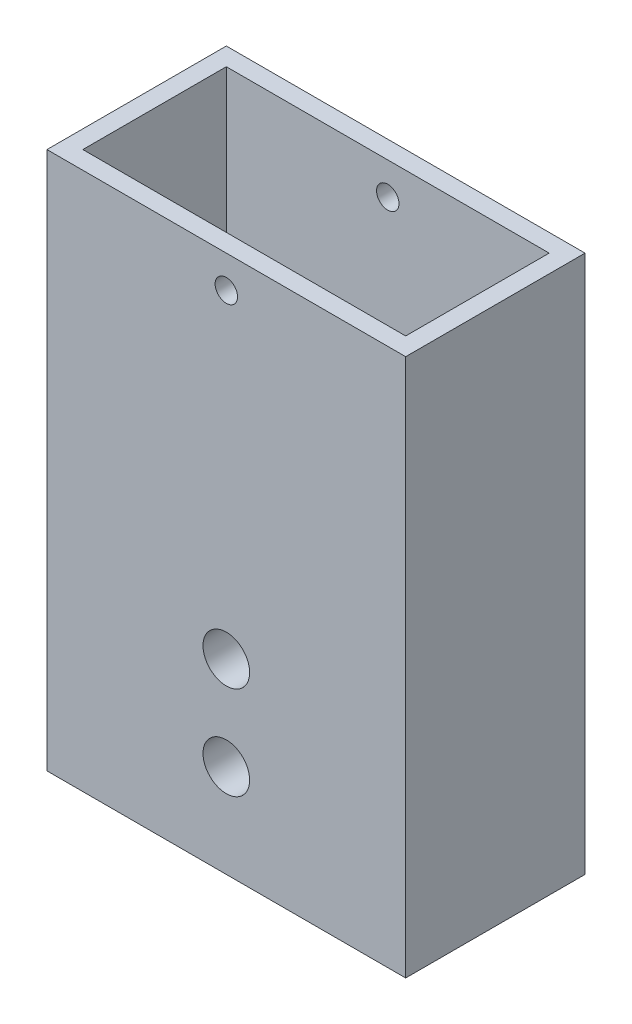
ISO-10303-21;
HEADER;
FILE_DESCRIPTION(('STEP AP214'),'2;1');
FILE_NAME('part.step','',(''),(''),'','','');
FILE_SCHEMA(('AUTOMOTIVE_DESIGN { 1 0 10303 214 1 1 1 1 }'));
ENDSEC;
DATA;
#1=APPLICATION_CONTEXT('core data for automotive mechanical design processes');
#2=APPLICATION_PROTOCOL_DEFINITION('international standard','automotive_design',2000,#1);
#3=PRODUCT_CONTEXT('',#1,'mechanical');
#4=PRODUCT('Part','Part','',(#3));
#5=PRODUCT_RELATED_PRODUCT_CATEGORY('part','',(#4));
#6=PRODUCT_DEFINITION_FORMATION('','',#4);
#7=PRODUCT_DEFINITION_CONTEXT('part definition',#1,'design');
#8=PRODUCT_DEFINITION('design','',#6,#7);
#9=PRODUCT_DEFINITION_SHAPE('','',#8);
#10=(LENGTH_UNIT() NAMED_UNIT(*) SI_UNIT(.MILLI.,.METRE.));
#11=(NAMED_UNIT(*) PLANE_ANGLE_UNIT() SI_UNIT($,.RADIAN.));
#12=(NAMED_UNIT(*) SI_UNIT($,.STERADIAN.) SOLID_ANGLE_UNIT());
#13=UNCERTAINTY_MEASURE_WITH_UNIT(LENGTH_MEASURE(1.E-05),#10,'distance_accuracy_value','');
#14=(GEOMETRIC_REPRESENTATION_CONTEXT(3) GLOBAL_UNCERTAINTY_ASSIGNED_CONTEXT((#13)) GLOBAL_UNIT_ASSIGNED_CONTEXT((#10,
#11,#12)) REPRESENTATION_CONTEXT('',''));
#15=CARTESIAN_POINT('',(0.,0.,0.));
#16=DIRECTION('',(0.,0.,1.));
#17=DIRECTION('',(1.,0.,0.));
#18=AXIS2_PLACEMENT_3D('',#15,#16,#17);
#19=CARTESIAN_POINT('',(0.,0.,25.4));
#20=DIRECTION('',(0.,0.,-1.));
#21=DIRECTION('',(-1.,0.,0.));
#22=AXIS2_PLACEMENT_3D('',#19,#20,#21);
#23=PLANE('',#22);
#24=CARTESIAN_POINT('',(25.4,71.628,25.4));
#25=DIRECTION('',(0.,0.,1.));
#26=DIRECTION('',(1.,0.,0.));
#27=AXIS2_PLACEMENT_3D('',#24,#25,#26);
#28=CIRCLE('',#27,1.5875);
#29=CARTESIAN_POINT('',(26.9875,71.628,25.4));
#30=VERTEX_POINT('',#29);
#31=EDGE_CURVE('E287',#30,#30,#28,.T.);
#32=ORIENTED_EDGE('',*,*,#31,.F.);
#33=EDGE_LOOP('',(#32));
#34=FACE_BOUND('',#33,.T.);
#35=DIRECTION('',(0.,-1.,0.));
#36=VECTOR('',#35,1.);
#37=CARTESIAN_POINT('',(0.,0.,25.4));
#38=LINE('',#37,#36);
#39=CARTESIAN_POINT('',(0.,76.2,25.4));
#40=VERTEX_POINT('',#39);
#41=CARTESIAN_POINT('',(0.,0.,25.4));
#42=VERTEX_POINT('',#41);
#43=EDGE_CURVE('E185',#40,#42,#38,.T.);
#44=ORIENTED_EDGE('',*,*,#43,.T.);
#45=DIRECTION('',(1.,0.,0.));
#46=VECTOR('',#45,1.);
#47=CARTESIAN_POINT('',(0.,0.,25.4));
#48=LINE('',#47,#46);
#49=CARTESIAN_POINT('',(50.8,0.,25.4));
#50=VERTEX_POINT('',#49);
#51=EDGE_CURVE('E93',#42,#50,#48,.T.);
#52=ORIENTED_EDGE('',*,*,#51,.T.);
#53=DIRECTION('',(0.,1.,0.));
#54=VECTOR('',#53,1.);
#55=CARTESIAN_POINT('',(50.8,0.,25.4));
#56=LINE('',#55,#54);
#57=CARTESIAN_POINT('',(50.8,76.2,25.4));
#58=VERTEX_POINT('',#57);
#59=EDGE_CURVE('E190',#50,#58,#56,.T.);
#60=ORIENTED_EDGE('',*,*,#59,.T.);
#61=DIRECTION('',(-1.,0.,0.));
#62=VECTOR('',#61,1.);
#63=CARTESIAN_POINT('',(0.,76.2,25.4));
#64=LINE('',#63,#62);
#65=EDGE_CURVE('E65',#58,#40,#64,.T.);
#66=ORIENTED_EDGE('',*,*,#65,.T.);
#67=EDGE_LOOP('',(#44,#52,#60,#66));
#68=FACE_BOUND('',#67,.T.);
#69=CARTESIAN_POINT('',(25.4,13.208,25.4));
#70=DIRECTION('',(0.,0.,1.));
#71=DIRECTION('',(1.,0.,0.));
#72=AXIS2_PLACEMENT_3D('',#69,#70,#71);
#73=CIRCLE('',#72,3.302);
#74=CARTESIAN_POINT('',(28.702,13.208,25.4));
#75=VERTEX_POINT('',#74);
#76=EDGE_CURVE('E177',#75,#75,#73,.T.);
#77=ORIENTED_EDGE('',*,*,#76,.F.);
#78=EDGE_LOOP('',(#77));
#79=FACE_BOUND('',#78,.T.);
#80=CARTESIAN_POINT('',(25.4,26.416,25.4));
#81=DIRECTION('',(0.,0.,1.));
#82=DIRECTION('',(1.,0.,0.));
#83=AXIS2_PLACEMENT_3D('',#80,#81,#82);
#84=CIRCLE('',#83,3.302);
#85=CARTESIAN_POINT('',(28.702,26.416,25.4));
#86=VERTEX_POINT('',#85);
#87=EDGE_CURVE('E169',#86,#86,#84,.T.);
#88=ORIENTED_EDGE('',*,*,#87,.F.);
#89=EDGE_LOOP('',(#88));
#90=FACE_BOUND('',#89,.T.);
#91=ADVANCED_FACE('F39',(#34,#68,#79,#90),#23,.F.);
#92=CARTESIAN_POINT('',(0.,0.,0.));
#93=DIRECTION('',(0.,0.,-1.));
#94=DIRECTION('',(-1.,0.,0.));
#95=AXIS2_PLACEMENT_3D('',#92,#93,#94);
#96=PLANE('',#95);
#97=CARTESIAN_POINT('',(25.4,71.628,0.));
#98=DIRECTION('',(0.,0.,1.));
#99=DIRECTION('',(1.,0.,0.));
#100=AXIS2_PLACEMENT_3D('',#97,#98,#99);
#101=CIRCLE('',#100,1.5875);
#102=CARTESIAN_POINT('',(26.9875,71.628,0.));
#103=VERTEX_POINT('',#102);
#104=EDGE_CURVE('E279',#103,#103,#101,.T.);
#105=ORIENTED_EDGE('',*,*,#104,.T.);
#106=EDGE_LOOP('',(#105));
#107=FACE_BOUND('',#106,.T.);
#108=CARTESIAN_POINT('',(25.4,13.208,0.));
#109=DIRECTION('',(0.,0.,1.));
#110=DIRECTION('',(1.,0.,0.));
#111=AXIS2_PLACEMENT_3D('',#108,#109,#110);
#112=CIRCLE('',#111,3.302);
#113=CARTESIAN_POINT('',(28.702,13.208,0.));
#114=VERTEX_POINT('',#113);
#115=EDGE_CURVE('E173',#114,#114,#112,.T.);
#116=ORIENTED_EDGE('',*,*,#115,.T.);
#117=EDGE_LOOP('',(#116));
#118=FACE_BOUND('',#117,.T.);
#119=DIRECTION('',(0.,-1.,0.));
#120=VECTOR('',#119,1.);
#121=CARTESIAN_POINT('',(0.,0.,0.));
#122=LINE('',#121,#120);
#123=CARTESIAN_POINT('',(0.,76.2,0.));
#124=VERTEX_POINT('',#123);
#125=CARTESIAN_POINT('',(0.,0.,0.));
#126=VERTEX_POINT('',#125);
#127=EDGE_CURVE('E181',#124,#126,#122,.T.);
#128=ORIENTED_EDGE('',*,*,#127,.F.);
#129=DIRECTION('',(-1.,0.,0.));
#130=VECTOR('',#129,1.);
#131=CARTESIAN_POINT('',(0.,76.2,0.));
#132=LINE('',#131,#130);
#133=CARTESIAN_POINT('',(50.8,76.2,0.));
#134=VERTEX_POINT('',#133);
#135=EDGE_CURVE('E86',#134,#124,#132,.T.);
#136=ORIENTED_EDGE('',*,*,#135,.F.);
#137=DIRECTION('',(0.,1.,0.));
#138=VECTOR('',#137,1.);
#139=CARTESIAN_POINT('',(50.8,0.,0.));
#140=LINE('',#139,#138);
#141=CARTESIAN_POINT('',(50.8,0.,0.));
#142=VERTEX_POINT('',#141);
#143=EDGE_CURVE('E202',#142,#134,#140,.T.);
#144=ORIENTED_EDGE('',*,*,#143,.F.);
#145=DIRECTION('',(1.,0.,0.));
#146=VECTOR('',#145,1.);
#147=CARTESIAN_POINT('',(0.,0.,0.));
#148=LINE('',#147,#146);
#149=EDGE_CURVE('E199',#126,#142,#148,.T.);
#150=ORIENTED_EDGE('',*,*,#149,.F.);
#151=EDGE_LOOP('',(#128,#136,#144,#150));
#152=FACE_BOUND('',#151,.T.);
#153=CARTESIAN_POINT('',(25.4,26.416,0.));
#154=DIRECTION('',(0.,0.,1.));
#155=DIRECTION('',(1.,0.,0.));
#156=AXIS2_PLACEMENT_3D('',#153,#154,#155);
#157=CIRCLE('',#156,3.302);
#158=CARTESIAN_POINT('',(28.702,26.416,0.));
#159=VERTEX_POINT('',#158);
#160=EDGE_CURVE('E163',#159,#159,#157,.T.);
#161=ORIENTED_EDGE('',*,*,#160,.T.);
#162=EDGE_LOOP('',(#161));
#163=FACE_BOUND('',#162,.T.);
#164=ADVANCED_FACE('F221',(#107,#118,#152,#163),#96,.T.);
#165=CARTESIAN_POINT('',(0.,0.,25.4));
#166=DIRECTION('',(1.,0.,0.));
#167=DIRECTION('',(0.,0.,-1.));
#168=AXIS2_PLACEMENT_3D('',#165,#166,#167);
#169=PLANE('',#168);
#170=ORIENTED_EDGE('',*,*,#127,.T.);
#171=DIRECTION('',(0.,0.,-1.));
#172=VECTOR('',#171,1.);
#173=CARTESIAN_POINT('',(0.,0.,25.4));
#174=LINE('',#173,#172);
#175=EDGE_CURVE('E11',#42,#126,#174,.T.);
#176=ORIENTED_EDGE('',*,*,#175,.F.);
#177=ORIENTED_EDGE('',*,*,#43,.F.);
#178=DIRECTION('',(0.,0.,-1.));
#179=VECTOR('',#178,1.);
#180=CARTESIAN_POINT('',(0.,76.2,25.4));
#181=LINE('',#180,#179);
#182=EDGE_CURVE('E195',#40,#124,#181,.T.);
#183=ORIENTED_EDGE('',*,*,#182,.T.);
#184=EDGE_LOOP('',(#170,#176,#177,#183));
#185=FACE_BOUND('',#184,.T.);
#186=ADVANCED_FACE('F41',(#185),#169,.F.);
#187=CARTESIAN_POINT('',(0.,0.,25.4));
#188=DIRECTION('',(0.,1.,0.));
#189=DIRECTION('',(0.,0.,1.));
#190=AXIS2_PLACEMENT_3D('',#187,#188,#189);
#191=PLANE('',#190);
#192=ORIENTED_EDGE('',*,*,#149,.T.);
#193=DIRECTION('',(0.,0.,-1.));
#194=VECTOR('',#193,1.);
#195=CARTESIAN_POINT('',(50.8,0.,25.4));
#196=LINE('',#195,#194);
#197=EDGE_CURVE('E49',#50,#142,#196,.T.);
#198=ORIENTED_EDGE('',*,*,#197,.F.);
#199=ORIENTED_EDGE('',*,*,#51,.F.);
#200=ORIENTED_EDGE('',*,*,#175,.T.);
#201=EDGE_LOOP('',(#192,#198,#199,#200));
#202=FACE_BOUND('',#201,.T.);
#203=ADVANCED_FACE('F238',(#202),#191,.F.);
#204=CARTESIAN_POINT('',(50.8,0.,25.4));
#205=DIRECTION('',(-1.,0.,0.));
#206=DIRECTION('',(0.,0.,1.));
#207=AXIS2_PLACEMENT_3D('',#204,#205,#206);
#208=PLANE('',#207);
#209=ORIENTED_EDGE('',*,*,#143,.T.);
#210=DIRECTION('',(0.,0.,-1.));
#211=VECTOR('',#210,1.);
#212=CARTESIAN_POINT('',(50.8,76.2,25.4));
#213=LINE('',#212,#211);
#214=EDGE_CURVE('E209',#58,#134,#213,.T.);
#215=ORIENTED_EDGE('',*,*,#214,.F.);
#216=ORIENTED_EDGE('',*,*,#59,.F.);
#217=ORIENTED_EDGE('',*,*,#197,.T.);
#218=EDGE_LOOP('',(#209,#215,#216,#217));
#219=FACE_BOUND('',#218,.T.);
#220=ADVANCED_FACE('F217',(#219),#208,.F.);
#221=CARTESIAN_POINT('',(0.,76.2,25.4));
#222=DIRECTION('',(0.,-1.,0.));
#223=DIRECTION('',(0.,0.,-1.));
#224=AXIS2_PLACEMENT_3D('',#221,#222,#223);
#225=PLANE('',#224);
#226=DIRECTION('',(1.,0.,0.));
#227=VECTOR('',#226,1.);
#228=CARTESIAN_POINT('',(2.54,76.2,22.86));
#229=LINE('',#228,#227);
#230=CARTESIAN_POINT('',(2.54,76.2,22.86));
#231=VERTEX_POINT('',#230);
#232=CARTESIAN_POINT('',(48.26,76.2,22.86));
#233=VERTEX_POINT('',#232);
#234=EDGE_CURVE('E154',#231,#233,#229,.T.);
#235=ORIENTED_EDGE('',*,*,#234,.F.);
#236=DIRECTION('',(0.,0.,1.));
#237=VECTOR('',#236,1.);
#238=CARTESIAN_POINT('',(2.54,76.2,2.54));
#239=LINE('',#238,#237);
#240=CARTESIAN_POINT('',(2.54,76.2,2.54));
#241=VERTEX_POINT('',#240);
#242=EDGE_CURVE('E56',#241,#231,#239,.T.);
#243=ORIENTED_EDGE('',*,*,#242,.F.);
#244=DIRECTION('',(-1.,0.,0.));
#245=VECTOR('',#244,1.);
#246=CARTESIAN_POINT('',(2.54,76.2,2.54));
#247=LINE('',#246,#245);
#248=CARTESIAN_POINT('',(48.26,76.2,2.54));
#249=VERTEX_POINT('',#248);
#250=EDGE_CURVE('E138',#249,#241,#247,.T.);
#251=ORIENTED_EDGE('',*,*,#250,.F.);
#252=DIRECTION('',(0.,0.,-1.));
#253=VECTOR('',#252,1.);
#254=CARTESIAN_POINT('',(48.26,76.2,2.54));
#255=LINE('',#254,#253);
#256=EDGE_CURVE('E142',#233,#249,#255,.T.);
#257=ORIENTED_EDGE('',*,*,#256,.F.);
#258=EDGE_LOOP('',(#235,#243,#251,#257));
#259=FACE_BOUND('',#258,.T.);
#260=ORIENTED_EDGE('',*,*,#135,.T.);
#261=ORIENTED_EDGE('',*,*,#182,.F.);
#262=ORIENTED_EDGE('',*,*,#65,.F.);
#263=ORIENTED_EDGE('',*,*,#214,.T.);
#264=EDGE_LOOP('',(#260,#261,#262,#263));
#265=FACE_BOUND('',#264,.T.);
#266=ADVANCED_FACE('F226',(#259,#265),#225,.F.);
#267=CARTESIAN_POINT('',(25.4,13.208,25.4));
#268=DIRECTION('',(0.,0.,-1.));
#269=DIRECTION('',(-1.,0.,0.));
#270=AXIS2_PLACEMENT_3D('',#267,#268,#269);
#271=CYLINDRICAL_SURFACE('',#270,3.302);
#272=ORIENTED_EDGE('',*,*,#76,.T.);
#273=EDGE_LOOP('',(#272));
#274=FACE_BOUND('',#273,.T.);
#275=ORIENTED_EDGE('',*,*,#115,.F.);
#276=EDGE_LOOP('',(#275));
#277=FACE_BOUND('',#276,.T.);
#278=ADVANCED_FACE('F228',(#274,#277),#271,.F.);
#279=CARTESIAN_POINT('',(25.4,26.416,25.4));
#280=DIRECTION('',(0.,0.,-1.));
#281=DIRECTION('',(-1.,0.,0.));
#282=AXIS2_PLACEMENT_3D('',#279,#280,#281);
#283=CYLINDRICAL_SURFACE('',#282,3.302);
#284=ORIENTED_EDGE('',*,*,#87,.T.);
#285=EDGE_LOOP('',(#284));
#286=FACE_BOUND('',#285,.T.);
#287=ORIENTED_EDGE('',*,*,#160,.F.);
#288=EDGE_LOOP('',(#287));
#289=FACE_BOUND('',#288,.T.);
#290=ADVANCED_FACE('F235',(#286,#289),#283,.F.);
#291=CARTESIAN_POINT('',(2.54,38.1,2.54));
#292=DIRECTION('',(-1.,0.,0.));
#293=DIRECTION('',(0.,0.,1.));
#294=AXIS2_PLACEMENT_3D('',#291,#292,#293);
#295=PLANE('',#294);
#296=ORIENTED_EDGE('',*,*,#242,.T.);
#297=DIRECTION('',(0.,1.,0.));
#298=VECTOR('',#297,1.);
#299=CARTESIAN_POINT('',(2.54,38.1,22.86));
#300=LINE('',#299,#298);
#301=CARTESIAN_POINT('',(2.54,38.1,22.86));
#302=VERTEX_POINT('',#301);
#303=EDGE_CURVE('E113',#302,#231,#300,.T.);
#304=ORIENTED_EDGE('',*,*,#303,.F.);
#305=DIRECTION('',(0.,0.,1.));
#306=VECTOR('',#305,1.);
#307=CARTESIAN_POINT('',(2.54,38.1,2.54));
#308=LINE('',#307,#306);
#309=CARTESIAN_POINT('',(2.54,38.1,2.54));
#310=VERTEX_POINT('',#309);
#311=EDGE_CURVE('E117',#310,#302,#308,.T.);
#312=ORIENTED_EDGE('',*,*,#311,.F.);
#313=DIRECTION('',(0.,1.,0.));
#314=VECTOR('',#313,1.);
#315=CARTESIAN_POINT('',(2.54,38.1,2.54));
#316=LINE('',#315,#314);
#317=EDGE_CURVE('E160',#310,#241,#316,.T.);
#318=ORIENTED_EDGE('',*,*,#317,.T.);
#319=EDGE_LOOP('',(#296,#304,#312,#318));
#320=FACE_BOUND('',#319,.T.);
#321=ADVANCED_FACE('F115',(#320),#295,.F.);
#322=CARTESIAN_POINT('',(2.54,38.1,2.54));
#323=DIRECTION('',(0.,0.,-1.));
#324=DIRECTION('',(-1.,0.,0.));
#325=AXIS2_PLACEMENT_3D('',#322,#323,#324);
#326=PLANE('',#325);
#327=CARTESIAN_POINT('',(25.4,71.628,2.54));
#328=DIRECTION('',(0.,0.,-1.));
#329=DIRECTION('',(-1.,0.,0.));
#330=AXIS2_PLACEMENT_3D('',#327,#328,#329);
#331=CIRCLE('',#330,1.5875);
#332=CARTESIAN_POINT('',(23.8125,71.628,2.54));
#333=VERTEX_POINT('',#332);
#334=EDGE_CURVE('E145',#333,#333,#331,.T.);
#335=ORIENTED_EDGE('',*,*,#334,.T.);
#336=EDGE_LOOP('',(#335));
#337=FACE_BOUND('',#336,.T.);
#338=ORIENTED_EDGE('',*,*,#250,.T.);
#339=ORIENTED_EDGE('',*,*,#317,.F.);
#340=DIRECTION('',(-1.,0.,0.));
#341=VECTOR('',#340,1.);
#342=CARTESIAN_POINT('',(2.54,38.1,2.54));
#343=LINE('',#342,#341);
#344=CARTESIAN_POINT('',(48.26,38.1,2.54));
#345=VERTEX_POINT('',#344);
#346=EDGE_CURVE('E124',#345,#310,#343,.T.);
#347=ORIENTED_EDGE('',*,*,#346,.F.);
#348=DIRECTION('',(0.,1.,0.));
#349=VECTOR('',#348,1.);
#350=CARTESIAN_POINT('',(48.26,38.1,2.54));
#351=LINE('',#350,#349);
#352=EDGE_CURVE('E164',#345,#249,#351,.T.);
#353=ORIENTED_EDGE('',*,*,#352,.T.);
#354=EDGE_LOOP('',(#338,#339,#347,#353));
#355=FACE_BOUND('',#354,.T.);
#356=ADVANCED_FACE('F255',(#337,#355),#326,.F.);
#357=CARTESIAN_POINT('',(48.26,38.1,2.54));
#358=DIRECTION('',(1.,0.,0.));
#359=DIRECTION('',(0.,0.,-1.));
#360=AXIS2_PLACEMENT_3D('',#357,#358,#359);
#361=PLANE('',#360);
#362=ORIENTED_EDGE('',*,*,#256,.T.);
#363=ORIENTED_EDGE('',*,*,#352,.F.);
#364=DIRECTION('',(0.,0.,-1.));
#365=VECTOR('',#364,1.);
#366=CARTESIAN_POINT('',(48.26,38.1,2.54));
#367=LINE('',#366,#365);
#368=CARTESIAN_POINT('',(48.26,38.1,22.86));
#369=VERTEX_POINT('',#368);
#370=EDGE_CURVE('E133',#369,#345,#367,.T.);
#371=ORIENTED_EDGE('',*,*,#370,.F.);
#372=DIRECTION('',(0.,1.,0.));
#373=VECTOR('',#372,1.);
#374=CARTESIAN_POINT('',(48.26,38.1,22.86));
#375=LINE('',#374,#373);
#376=EDGE_CURVE('E123',#369,#233,#375,.T.);
#377=ORIENTED_EDGE('',*,*,#376,.T.);
#378=EDGE_LOOP('',(#362,#363,#371,#377));
#379=FACE_BOUND('',#378,.T.);
#380=ADVANCED_FACE('F258',(#379),#361,.F.);
#381=CARTESIAN_POINT('',(2.54,38.1,22.86));
#382=DIRECTION('',(0.,0.,1.));
#383=DIRECTION('',(1.,0.,0.));
#384=AXIS2_PLACEMENT_3D('',#381,#382,#383);
#385=PLANE('',#384);
#386=CARTESIAN_POINT('',(25.4,71.628,22.86));
#387=DIRECTION('',(0.,0.,1.));
#388=DIRECTION('',(1.,0.,0.));
#389=AXIS2_PLACEMENT_3D('',#386,#387,#388);
#390=CIRCLE('',#389,1.5875);
#391=CARTESIAN_POINT('',(26.9875,71.628,22.86));
#392=VERTEX_POINT('',#391);
#393=EDGE_CURVE('E43',#392,#392,#390,.T.);
#394=ORIENTED_EDGE('',*,*,#393,.T.);
#395=EDGE_LOOP('',(#394));
#396=FACE_BOUND('',#395,.T.);
#397=ORIENTED_EDGE('',*,*,#234,.T.);
#398=ORIENTED_EDGE('',*,*,#376,.F.);
#399=DIRECTION('',(1.,0.,0.));
#400=VECTOR('',#399,1.);
#401=CARTESIAN_POINT('',(2.54,38.1,22.86));
#402=LINE('',#401,#400);
#403=EDGE_CURVE('E127',#302,#369,#402,.T.);
#404=ORIENTED_EDGE('',*,*,#403,.F.);
#405=ORIENTED_EDGE('',*,*,#303,.T.);
#406=EDGE_LOOP('',(#397,#398,#404,#405));
#407=FACE_BOUND('',#406,.T.);
#408=ADVANCED_FACE('F128',(#396,#407),#385,.F.);
#409=CARTESIAN_POINT('',(0.,38.1,0.));
#410=DIRECTION('',(0.,1.,0.));
#411=DIRECTION('',(0.,0.,1.));
#412=AXIS2_PLACEMENT_3D('',#409,#410,#411);
#413=PLANE('',#412);
#414=ORIENTED_EDGE('',*,*,#311,.T.);
#415=ORIENTED_EDGE('',*,*,#403,.T.);
#416=ORIENTED_EDGE('',*,*,#370,.T.);
#417=ORIENTED_EDGE('',*,*,#346,.T.);
#418=EDGE_LOOP('',(#414,#415,#416,#417));
#419=FACE_BOUND('',#418,.T.);
#420=ADVANCED_FACE('F135',(#419),#413,.T.);
#421=CARTESIAN_POINT('',(25.4,71.628,0.));
#422=DIRECTION('',(0.,0.,1.));
#423=DIRECTION('',(1.,0.,0.));
#424=AXIS2_PLACEMENT_3D('',#421,#422,#423);
#425=CYLINDRICAL_SURFACE('',#424,1.5875);
#426=ORIENTED_EDGE('',*,*,#31,.T.);
#427=EDGE_LOOP('',(#426));
#428=FACE_BOUND('',#427,.T.);
#429=ORIENTED_EDGE('',*,*,#393,.F.);
#430=EDGE_LOOP('',(#429));
#431=FACE_BOUND('',#430,.T.);
#432=ADVANCED_FACE('F268',(#428,#431),#425,.F.);
#433=ORIENTED_EDGE('',*,*,#104,.F.);
#434=EDGE_LOOP('',(#433));
#435=FACE_BOUND('',#434,.T.);
#436=ORIENTED_EDGE('',*,*,#334,.F.);
#437=EDGE_LOOP('',(#436));
#438=FACE_BOUND('',#437,.T.);
#439=ADVANCED_FACE('F269',(#435,#438),#425,.F.);
#440=CLOSED_SHELL('',(#91,#164,#186,#203,#220,#266,#278,#290,#321,#356,#380,#408,#420,#432,#439));
#441=MANIFOLD_SOLID_BREP('B2',#440);
#442=ADVANCED_BREP_SHAPE_REPRESENTATION('',(#18,#441),#14);
#443=SHAPE_DEFINITION_REPRESENTATION(#9,#442);
ENDSEC;
END-ISO-10303-21;
